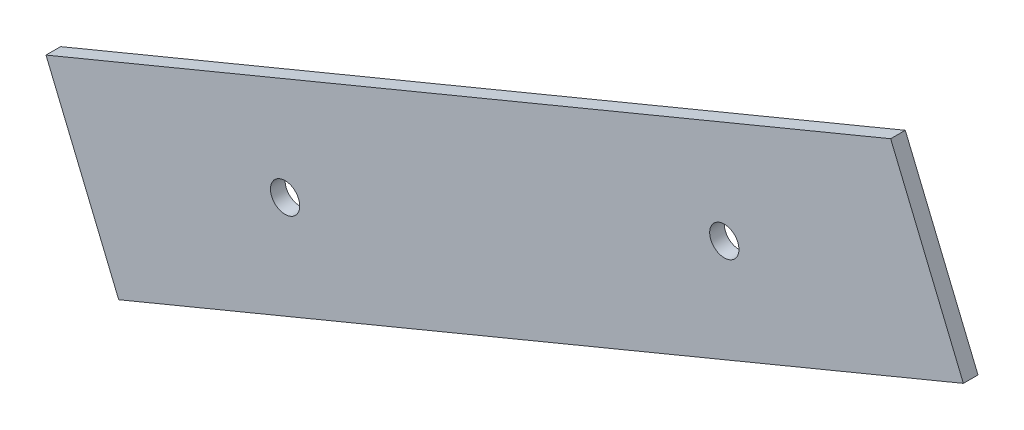
ISO-10303-21;
HEADER;
FILE_DESCRIPTION(('STEP AP214'),'2;1');
FILE_NAME('part.step','',(''),(''),'','','');
FILE_SCHEMA(('AUTOMOTIVE_DESIGN { 1 0 10303 214 1 1 1 1 }'));
ENDSEC;
DATA;
#1=APPLICATION_CONTEXT('core data for automotive mechanical design processes');
#2=APPLICATION_PROTOCOL_DEFINITION('international standard','automotive_design',2000,#1);
#3=PRODUCT_CONTEXT('',#1,'mechanical');
#4=PRODUCT('Part','Part','',(#3));
#5=PRODUCT_RELATED_PRODUCT_CATEGORY('part','',(#4));
#6=PRODUCT_DEFINITION_FORMATION('','',#4);
#7=PRODUCT_DEFINITION_CONTEXT('part definition',#1,'design');
#8=PRODUCT_DEFINITION('design','',#6,#7);
#9=PRODUCT_DEFINITION_SHAPE('','',#8);
#10=(LENGTH_UNIT() NAMED_UNIT(*) SI_UNIT(.MILLI.,.METRE.));
#11=(NAMED_UNIT(*) PLANE_ANGLE_UNIT() SI_UNIT($,.RADIAN.));
#12=(NAMED_UNIT(*) SI_UNIT($,.STERADIAN.) SOLID_ANGLE_UNIT());
#13=UNCERTAINTY_MEASURE_WITH_UNIT(LENGTH_MEASURE(1.E-05),#10,'distance_accuracy_value','');
#14=(GEOMETRIC_REPRESENTATION_CONTEXT(3) GLOBAL_UNCERTAINTY_ASSIGNED_CONTEXT((#13)) GLOBAL_UNIT_ASSIGNED_CONTEXT((#10,
#11,#12)) REPRESENTATION_CONTEXT('',''));
#15=CARTESIAN_POINT('',(0.,0.,0.));
#16=DIRECTION('',(0.,0.,1.));
#17=DIRECTION('',(1.,0.,0.));
#18=AXIS2_PLACEMENT_3D('',#15,#16,#17);
#19=CARTESIAN_POINT('',(0.,0.,2.));
#20=DIRECTION('',(0.,0.,1.));
#21=DIRECTION('',(1.,0.,0.));
#22=AXIS2_PLACEMENT_3D('',#19,#20,#21);
#23=PLANE('',#22);
#24=CARTESIAN_POINT('',(-24.1039971536032,-16.9108936385607,2.));
#25=DIRECTION('',(0.,0.,1.));
#26=DIRECTION('',(1.,0.,0.));
#27=AXIS2_PLACEMENT_3D('',#24,#25,#26);
#28=CIRCLE('',#27,1.99999999999999);
#29=CARTESIAN_POINT('',(-22.1039971536032,-16.9108936385607,2.));
#30=VERTEX_POINT('',#29);
#31=EDGE_CURVE('E99',#30,#30,#28,.T.);
#32=ORIENTED_EDGE('',*,*,#31,.F.);
#33=EDGE_LOOP('',(#32));
#34=FACE_BOUND('',#33,.T.);
#35=DIRECTION('',(-0.923879532511305,-0.382683432365047,0.));
#36=VECTOR('',#35,1.);
#37=CARTESIAN_POINT('',(-56.7911230448795,-16.3909688894257,2.));
#38=LINE('',#37,#36);
#39=CARTESIAN_POINT('',(58.6938185190335,31.4444601562051,2.));
#40=VERTEX_POINT('',#39);
#41=CARTESIAN_POINT('',(-56.7911230448795,-16.3909688894257,2.));
#42=VERTEX_POINT('',#41);
#43=EDGE_CURVE('E84',#40,#42,#38,.T.);
#44=ORIENTED_EDGE('',*,*,#43,.T.);
#45=DIRECTION('',(0.382683432365045,-0.923879532511306,0.));
#46=VECTOR('',#45,1.);
#47=CARTESIAN_POINT('',(-56.7911230448795,-16.3909688894257,2.));
#48=LINE('',#47,#46);
#49=CARTESIAN_POINT('',(-46.8496432130053,-40.3918243295983,2.));
#50=VERTEX_POINT('',#49);
#51=EDGE_CURVE('E79',#42,#50,#48,.T.);
#52=ORIENTED_EDGE('',*,*,#51,.T.);
#53=DIRECTION('',(0.923879532511305,0.382683432365047,0.));
#54=VECTOR('',#53,1.);
#55=CARTESIAN_POINT('',(-46.8496432130053,-40.3918243295983,2.));
#56=LINE('',#55,#54);
#57=CARTESIAN_POINT('',(68.6352983509077,7.4436047160325,2.));
#58=VERTEX_POINT('',#57);
#59=EDGE_CURVE('E82',#50,#58,#56,.T.);
#60=ORIENTED_EDGE('',*,*,#59,.T.);
#61=DIRECTION('',(-0.382683432365047,0.923879532511305,0.));
#62=VECTOR('',#61,1.);
#63=CARTESIAN_POINT('',(68.6352983509077,7.4436047160325,2.));
#64=LINE('',#63,#62);
#65=EDGE_CURVE('E49',#58,#40,#64,.T.);
#66=ORIENTED_EDGE('',*,*,#65,.T.);
#67=EDGE_LOOP('',(#44,#52,#60,#66));
#68=FACE_BOUND('',#67,.T.);
#69=CARTESIAN_POINT('',(35.9481724596315,7.96352946516719,2.));
#70=DIRECTION('',(0.,0.,1.));
#71=DIRECTION('',(1.,0.,0.));
#72=AXIS2_PLACEMENT_3D('',#69,#70,#71);
#73=CIRCLE('',#72,1.99999999999998);
#74=CARTESIAN_POINT('',(37.9481724596315,7.96352946516719,2.));
#75=VERTEX_POINT('',#74);
#76=EDGE_CURVE('E114',#75,#75,#73,.T.);
#77=ORIENTED_EDGE('',*,*,#76,.F.);
#78=EDGE_LOOP('',(#77));
#79=FACE_BOUND('',#78,.T.);
#80=ADVANCED_FACE('F32',(#34,#68,#79),#23,.T.);
#81=CARTESIAN_POINT('',(0.,0.,0.));
#82=DIRECTION('',(0.,0.,1.));
#83=DIRECTION('',(1.,0.,0.));
#84=AXIS2_PLACEMENT_3D('',#81,#82,#83);
#85=PLANE('',#84);
#86=DIRECTION('',(-0.923879532511305,-0.382683432365047,0.));
#87=VECTOR('',#86,1.);
#88=CARTESIAN_POINT('',(-56.7911230448795,-16.3909688894257,0.));
#89=LINE('',#88,#87);
#90=CARTESIAN_POINT('',(58.6938185190335,31.4444601562051,0.));
#91=VERTEX_POINT('',#90);
#92=CARTESIAN_POINT('',(-56.7911230448795,-16.3909688894257,0.));
#93=VERTEX_POINT('',#92);
#94=EDGE_CURVE('E96',#91,#93,#89,.T.);
#95=ORIENTED_EDGE('',*,*,#94,.F.);
#96=DIRECTION('',(-0.382683432365047,0.923879532511305,0.));
#97=VECTOR('',#96,1.);
#98=CARTESIAN_POINT('',(68.6352983509077,7.4436047160325,0.));
#99=LINE('',#98,#97);
#100=CARTESIAN_POINT('',(68.6352983509077,7.4436047160325,0.));
#101=VERTEX_POINT('',#100);
#102=EDGE_CURVE('E72',#101,#91,#99,.T.);
#103=ORIENTED_EDGE('',*,*,#102,.F.);
#104=DIRECTION('',(0.923879532511305,0.382683432365047,0.));
#105=VECTOR('',#104,1.);
#106=CARTESIAN_POINT('',(-46.8496432130053,-40.3918243295983,0.));
#107=LINE('',#106,#105);
#108=CARTESIAN_POINT('',(-46.8496432130053,-40.3918243295983,0.));
#109=VERTEX_POINT('',#108);
#110=EDGE_CURVE('E66',#109,#101,#107,.T.);
#111=ORIENTED_EDGE('',*,*,#110,.F.);
#112=DIRECTION('',(0.382683432365045,-0.923879532511306,0.));
#113=VECTOR('',#112,1.);
#114=CARTESIAN_POINT('',(-56.7911230448795,-16.3909688894257,0.));
#115=LINE('',#114,#113);
#116=EDGE_CURVE('E88',#93,#109,#115,.T.);
#117=ORIENTED_EDGE('',*,*,#116,.F.);
#118=EDGE_LOOP('',(#95,#103,#111,#117));
#119=FACE_BOUND('',#118,.T.);
#120=CARTESIAN_POINT('',(-24.1039971536032,-16.9108936385607,0.));
#121=DIRECTION('',(0.,0.,1.));
#122=DIRECTION('',(1.,0.,0.));
#123=AXIS2_PLACEMENT_3D('',#120,#121,#122);
#124=CIRCLE('',#123,1.99999999999999);
#125=CARTESIAN_POINT('',(-22.1039971536032,-16.9108936385607,0.));
#126=VERTEX_POINT('',#125);
#127=EDGE_CURVE('E111',#126,#126,#124,.T.);
#128=ORIENTED_EDGE('',*,*,#127,.T.);
#129=EDGE_LOOP('',(#128));
#130=FACE_BOUND('',#129,.T.);
#131=CARTESIAN_POINT('',(35.9481724596315,7.96352946516719,0.));
#132=DIRECTION('',(0.,0.,1.));
#133=DIRECTION('',(1.,0.,0.));
#134=AXIS2_PLACEMENT_3D('',#131,#132,#133);
#135=CIRCLE('',#134,1.99999999999998);
#136=CARTESIAN_POINT('',(37.9481724596315,7.96352946516719,0.));
#137=VERTEX_POINT('',#136);
#138=EDGE_CURVE('E117',#137,#137,#135,.T.);
#139=ORIENTED_EDGE('',*,*,#138,.T.);
#140=EDGE_LOOP('',(#139));
#141=FACE_BOUND('',#140,.T.);
#142=ADVANCED_FACE('F107',(#119,#130,#141),#85,.F.);
#143=CARTESIAN_POINT('',(-56.7911230448795,-16.3909688894257,2.));
#144=DIRECTION('',(0.382683432365047,-0.923879532511305,0.));
#145=DIRECTION('',(0.923879532511305,0.382683432365047,0.));
#146=AXIS2_PLACEMENT_3D('',#143,#144,#145);
#147=PLANE('',#146);
#148=ORIENTED_EDGE('',*,*,#94,.T.);
#149=DIRECTION('',(0.,0.,-1.));
#150=VECTOR('',#149,1.);
#151=CARTESIAN_POINT('',(-56.7911230448795,-16.3909688894257,2.));
#152=LINE('',#151,#150);
#153=EDGE_CURVE('E11',#42,#93,#152,.T.);
#154=ORIENTED_EDGE('',*,*,#153,.F.);
#155=ORIENTED_EDGE('',*,*,#43,.F.);
#156=DIRECTION('',(0.,0.,-1.));
#157=VECTOR('',#156,1.);
#158=CARTESIAN_POINT('',(58.6938185190335,31.4444601562051,2.));
#159=LINE('',#158,#157);
#160=EDGE_CURVE('E92',#40,#91,#159,.T.);
#161=ORIENTED_EDGE('',*,*,#160,.T.);
#162=EDGE_LOOP('',(#148,#154,#155,#161));
#163=FACE_BOUND('',#162,.T.);
#164=ADVANCED_FACE('F34',(#163),#147,.F.);
#165=CARTESIAN_POINT('',(-56.7911230448795,-16.3909688894257,2.));
#166=DIRECTION('',(0.923879532511305,0.382683432365045,0.));
#167=DIRECTION('',(-0.382683432365045,0.923879532511306,0.));
#168=AXIS2_PLACEMENT_3D('',#165,#166,#167);
#169=PLANE('',#168);
#170=ORIENTED_EDGE('',*,*,#116,.T.);
#171=DIRECTION('',(0.,0.,-1.));
#172=VECTOR('',#171,1.);
#173=CARTESIAN_POINT('',(-46.8496432130053,-40.3918243295983,2.));
#174=LINE('',#173,#172);
#175=EDGE_CURVE('E41',#50,#109,#174,.T.);
#176=ORIENTED_EDGE('',*,*,#175,.F.);
#177=ORIENTED_EDGE('',*,*,#51,.F.);
#178=ORIENTED_EDGE('',*,*,#153,.T.);
#179=EDGE_LOOP('',(#170,#176,#177,#178));
#180=FACE_BOUND('',#179,.T.);
#181=ADVANCED_FACE('F87',(#180),#169,.F.);
#182=CARTESIAN_POINT('',(-46.8496432130053,-40.3918243295983,2.));
#183=DIRECTION('',(-0.382683432365047,0.923879532511305,0.));
#184=DIRECTION('',(-0.923879532511305,-0.382683432365047,0.));
#185=AXIS2_PLACEMENT_3D('',#182,#183,#184);
#186=PLANE('',#185);
#187=ORIENTED_EDGE('',*,*,#110,.T.);
#188=DIRECTION('',(0.,0.,-1.));
#189=VECTOR('',#188,1.);
#190=CARTESIAN_POINT('',(68.6352983509077,7.4436047160325,2.));
#191=LINE('',#190,#189);
#192=EDGE_CURVE('E89',#58,#101,#191,.T.);
#193=ORIENTED_EDGE('',*,*,#192,.F.);
#194=ORIENTED_EDGE('',*,*,#59,.F.);
#195=ORIENTED_EDGE('',*,*,#175,.T.);
#196=EDGE_LOOP('',(#187,#193,#194,#195));
#197=FACE_BOUND('',#196,.T.);
#198=ADVANCED_FACE('F90',(#197),#186,.F.);
#199=CARTESIAN_POINT('',(68.6352983509077,7.4436047160325,2.));
#200=DIRECTION('',(-0.923879532511305,-0.382683432365047,0.));
#201=DIRECTION('',(0.382683432365047,-0.923879532511305,0.));
#202=AXIS2_PLACEMENT_3D('',#199,#200,#201);
#203=PLANE('',#202);
#204=ORIENTED_EDGE('',*,*,#102,.T.);
#205=ORIENTED_EDGE('',*,*,#160,.F.);
#206=ORIENTED_EDGE('',*,*,#65,.F.);
#207=ORIENTED_EDGE('',*,*,#192,.T.);
#208=EDGE_LOOP('',(#204,#205,#206,#207));
#209=FACE_BOUND('',#208,.T.);
#210=ADVANCED_FACE('F104',(#209),#203,.F.);
#211=CARTESIAN_POINT('',(-24.1039971536032,-16.9108936385607,2.));
#212=DIRECTION('',(0.,0.,-1.));
#213=DIRECTION('',(-1.,0.,0.));
#214=AXIS2_PLACEMENT_3D('',#211,#212,#213);
#215=CYLINDRICAL_SURFACE('',#214,1.99999999999999);
#216=ORIENTED_EDGE('',*,*,#31,.T.);
#217=EDGE_LOOP('',(#216));
#218=FACE_BOUND('',#217,.T.);
#219=ORIENTED_EDGE('',*,*,#127,.F.);
#220=EDGE_LOOP('',(#219));
#221=FACE_BOUND('',#220,.T.);
#222=ADVANCED_FACE('F134',(#218,#221),#215,.F.);
#223=CARTESIAN_POINT('',(35.9481724596315,7.96352946516719,2.));
#224=DIRECTION('',(0.,0.,-1.));
#225=DIRECTION('',(-1.,0.,0.));
#226=AXIS2_PLACEMENT_3D('',#223,#224,#225);
#227=CYLINDRICAL_SURFACE('',#226,1.99999999999998);
#228=ORIENTED_EDGE('',*,*,#76,.T.);
#229=EDGE_LOOP('',(#228));
#230=FACE_BOUND('',#229,.T.);
#231=ORIENTED_EDGE('',*,*,#138,.F.);
#232=EDGE_LOOP('',(#231));
#233=FACE_BOUND('',#232,.T.);
#234=ADVANCED_FACE('F123',(#230,#233),#227,.F.);
#235=CLOSED_SHELL('',(#80,#142,#164,#181,#198,#210,#222,#234));
#236=MANIFOLD_SOLID_BREP('B2',#235);
#237=ADVANCED_BREP_SHAPE_REPRESENTATION('',(#18,#236),#14);
#238=SHAPE_DEFINITION_REPRESENTATION(#9,#237);
ENDSEC;
END-ISO-10303-21;
